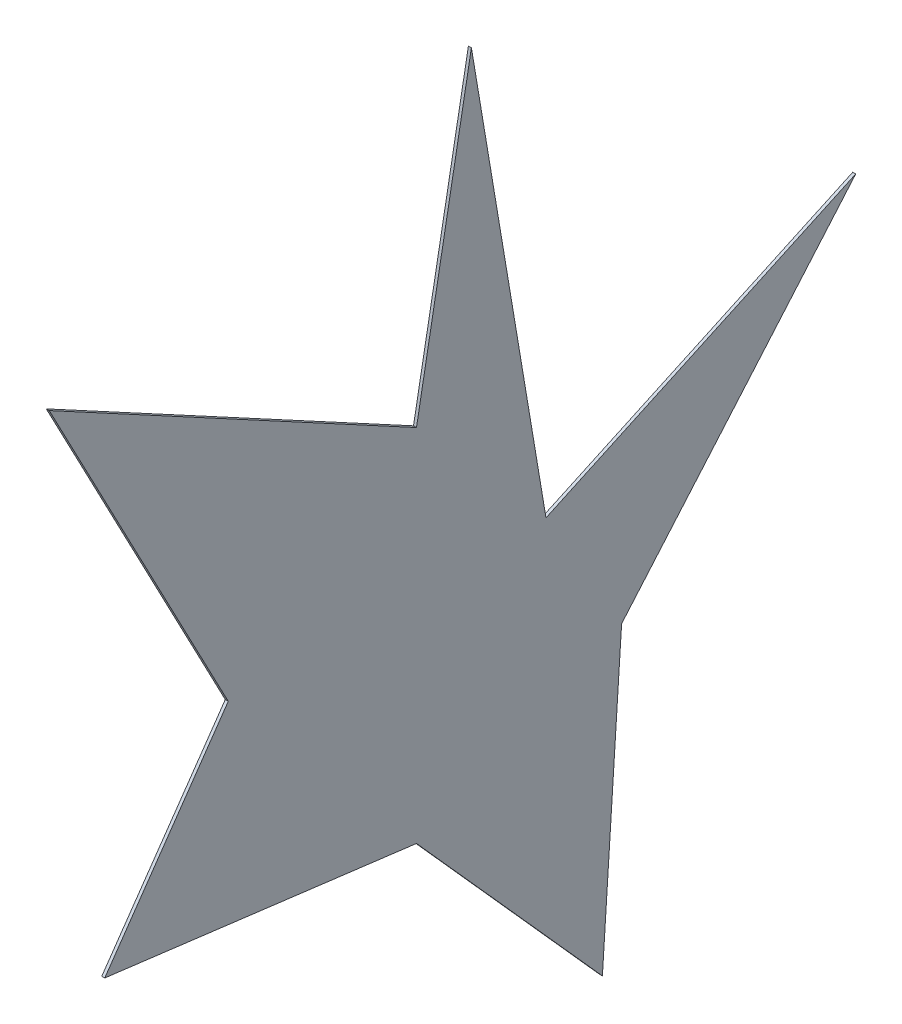
ISO-10303-21;
HEADER;
FILE_DESCRIPTION(('STEP AP214'),'2;1');
FILE_NAME('part.step','',(''),(''),'','','');
FILE_SCHEMA(('AUTOMOTIVE_DESIGN { 1 0 10303 214 1 1 1 1 }'));
ENDSEC;
DATA;
#1=APPLICATION_CONTEXT('core data for automotive mechanical design processes');
#2=APPLICATION_PROTOCOL_DEFINITION('international standard','automotive_design',2000,#1);
#3=PRODUCT_CONTEXT('',#1,'mechanical');
#4=PRODUCT('Part','Part','',(#3));
#5=PRODUCT_RELATED_PRODUCT_CATEGORY('part','',(#4));
#6=PRODUCT_DEFINITION_FORMATION('','',#4);
#7=PRODUCT_DEFINITION_CONTEXT('part definition',#1,'design');
#8=PRODUCT_DEFINITION('design','',#6,#7);
#9=PRODUCT_DEFINITION_SHAPE('','',#8);
#10=(LENGTH_UNIT() NAMED_UNIT(*) SI_UNIT(.MILLI.,.METRE.));
#11=(NAMED_UNIT(*) PLANE_ANGLE_UNIT() SI_UNIT($,.RADIAN.));
#12=(NAMED_UNIT(*) SI_UNIT($,.STERADIAN.) SOLID_ANGLE_UNIT());
#13=UNCERTAINTY_MEASURE_WITH_UNIT(LENGTH_MEASURE(1.E-05),#10,'distance_accuracy_value','');
#14=(GEOMETRIC_REPRESENTATION_CONTEXT(3) GLOBAL_UNCERTAINTY_ASSIGNED_CONTEXT((#13)) GLOBAL_UNIT_ASSIGNED_CONTEXT((#10,
#11,#12)) REPRESENTATION_CONTEXT('',''));
#15=CARTESIAN_POINT('',(0.,0.,0.));
#16=DIRECTION('',(0.,0.,1.));
#17=DIRECTION('',(1.,0.,0.));
#18=AXIS2_PLACEMENT_3D('',#15,#16,#17);
#19=CARTESIAN_POINT('',(10.,-2868.23222967355,4587.69998920282));
#20=DIRECTION('',(0.,-0.464531669646279,0.885556507454855));
#21=DIRECTION('',(0.,-0.885556507454855,-0.464531669646279));
#22=AXIS2_PLACEMENT_3D('',#19,#20,#21);
#23=PLANE('',#22);
#24=DIRECTION('',(0.,0.885556507454854,0.464531669646279));
#25=VECTOR('',#24,1.);
#26=CARTESIAN_POINT('',(0.,-2868.23222967355,4587.69998920282));
#27=LINE('',#26,#25);
#28=CARTESIAN_POINT('',(0.,-2868.23222967355,4587.69998920282));
#29=VERTEX_POINT('',#28);
#30=CARTESIAN_POINT('',(0.,-1720.99502231333,5189.5001125479));
#31=VERTEX_POINT('',#30);
#32=EDGE_CURVE('E146',#29,#31,#27,.T.);
#33=ORIENTED_EDGE('',*,*,#32,.F.);
#34=DIRECTION('',(-1.,0.,0.));
#35=VECTOR('',#34,1.);
#36=CARTESIAN_POINT('',(10.,-2868.23222967355,4587.69998920282));
#37=LINE('',#36,#35);
#38=CARTESIAN_POINT('',(10.,-2868.23222967355,4587.69998920282));
#39=VERTEX_POINT('',#38);
#40=EDGE_CURVE('E11',#39,#29,#37,.T.);
#41=ORIENTED_EDGE('',*,*,#40,.F.);
#42=DIRECTION('',(0.,0.885556507454854,0.464531669646279));
#43=VECTOR('',#42,1.);
#44=CARTESIAN_POINT('',(10.,-2868.23222967355,4587.69998920282));
#45=LINE('',#44,#43);
#46=CARTESIAN_POINT('',(10.,-1720.99502231333,5189.5001125479));
#47=VERTEX_POINT('',#46);
#48=EDGE_CURVE('E172',#39,#47,#45,.T.);
#49=ORIENTED_EDGE('',*,*,#48,.T.);
#50=DIRECTION('',(-1.,0.,0.));
#51=VECTOR('',#50,1.);
#52=CARTESIAN_POINT('',(10.,-1720.99502231333,5189.5001125479));
#53=LINE('',#52,#51);
#54=EDGE_CURVE('E40',#47,#31,#53,.T.);
#55=ORIENTED_EDGE('',*,*,#54,.T.);
#56=EDGE_LOOP('',(#33,#41,#49,#55));
#57=FACE_BOUND('',#56,.T.);
#58=ADVANCED_FACE('F37',(#57),#23,.T.);
#59=CARTESIAN_POINT('',(10.,-3466.21538001409,5002.94207431093));
#60=DIRECTION('',(0.,0.570373576526085,0.821385404789276));
#61=DIRECTION('',(0.,-0.821385404789276,0.570373576526085));
#62=AXIS2_PLACEMENT_3D('',#59,#60,#61);
#63=PLANE('',#62);
#64=DIRECTION('',(0.,0.821385404789276,-0.570373576526085));
#65=VECTOR('',#64,1.);
#66=CARTESIAN_POINT('',(0.,-3466.21538001409,5002.94207431093));
#67=LINE('',#66,#65);
#68=CARTESIAN_POINT('',(0.,-3466.21538001409,5002.94207431093));
#69=VERTEX_POINT('',#68);
#70=EDGE_CURVE('E170',#69,#29,#67,.T.);
#71=ORIENTED_EDGE('',*,*,#70,.F.);
#72=DIRECTION('',(-1.,0.,0.));
#73=VECTOR('',#72,1.);
#74=CARTESIAN_POINT('',(10.,-3466.21538001409,5002.94207431093));
#75=LINE('',#74,#73);
#76=CARTESIAN_POINT('',(10.,-3466.21538001409,5002.94207431093));
#77=VERTEX_POINT('',#76);
#78=EDGE_CURVE('E46',#77,#69,#75,.T.);
#79=ORIENTED_EDGE('',*,*,#78,.F.);
#80=DIRECTION('',(0.,0.821385404789276,-0.570373576526085));
#81=VECTOR('',#80,1.);
#82=CARTESIAN_POINT('',(10.,-3466.21538001409,5002.94207431093));
#83=LINE('',#82,#81);
#84=EDGE_CURVE('E136',#77,#39,#83,.T.);
#85=ORIENTED_EDGE('',*,*,#84,.T.);
#86=ORIENTED_EDGE('',*,*,#40,.T.);
#87=EDGE_LOOP('',(#71,#79,#85,#86));
#88=FACE_BOUND('',#87,.T.);
#89=ADVANCED_FACE('F188',(#88),#63,.T.);
#90=CARTESIAN_POINT('',(10.,-3598.61140715001,3954.91830395219));
#91=DIRECTION('',(0.,-0.992114720662734,0.12533308040699));
#92=DIRECTION('',(0.,-0.12533308040699,-0.992114720662734));
#93=AXIS2_PLACEMENT_3D('',#90,#91,#92);
#94=PLANE('',#93);
#95=DIRECTION('',(0.,0.12533308040699,0.992114720662734));
#96=VECTOR('',#95,1.);
#97=CARTESIAN_POINT('',(0.,-3598.61140715001,3954.91830395219));
#98=LINE('',#97,#96);
#99=CARTESIAN_POINT('',(0.,-3598.61140715001,3954.91830395219));
#100=VERTEX_POINT('',#99);
#101=EDGE_CURVE('E123',#100,#69,#98,.T.);
#102=ORIENTED_EDGE('',*,*,#101,.F.);
#103=DIRECTION('',(-1.,0.,0.));
#104=VECTOR('',#103,1.);
#105=CARTESIAN_POINT('',(10.,-3598.61140715001,3954.91830395219));
#106=LINE('',#105,#104);
#107=CARTESIAN_POINT('',(10.,-3598.61140715001,3954.91830395219));
#108=VERTEX_POINT('',#107);
#109=EDGE_CURVE('E118',#108,#100,#106,.T.);
#110=ORIENTED_EDGE('',*,*,#109,.F.);
#111=DIRECTION('',(0.,0.12533308040699,0.992114720662734));
#112=VECTOR('',#111,1.);
#113=CARTESIAN_POINT('',(10.,-3598.61140715001,3954.91830395219));
#114=LINE('',#113,#112);
#115=EDGE_CURVE('E121',#108,#77,#114,.T.);
#116=ORIENTED_EDGE('',*,*,#115,.T.);
#117=ORIENTED_EDGE('',*,*,#78,.T.);
#118=EDGE_LOOP('',(#102,#110,#116,#117));
#119=FACE_BOUND('',#118,.T.);
#120=ADVANCED_FACE('F120',(#119),#94,.T.);
#121=CARTESIAN_POINT('',(10.,-4296.69955023031,3329.93773141158));
#122=DIRECTION('',(0.,-0.667017339647899,0.745042192502572));
#123=DIRECTION('',(0.,-0.745042192502572,-0.667017339647899));
#124=AXIS2_PLACEMENT_3D('',#121,#122,#123);
#125=PLANE('',#124);
#126=DIRECTION('',(0.,0.745042192502572,0.667017339647899));
#127=VECTOR('',#126,1.);
#128=CARTESIAN_POINT('',(0.,-4296.69955023031,3329.93773141158));
#129=LINE('',#128,#127);
#130=CARTESIAN_POINT('',(0.,-4296.69955023031,3329.93773141158));
#131=VERTEX_POINT('',#130);
#132=EDGE_CURVE('E167',#131,#100,#129,.T.);
#133=ORIENTED_EDGE('',*,*,#132,.F.);
#134=DIRECTION('',(-1.,0.,0.));
#135=VECTOR('',#134,1.);
#136=CARTESIAN_POINT('',(10.,-4296.69955023031,3329.93773141158));
#137=LINE('',#136,#135);
#138=CARTESIAN_POINT('',(10.,-4296.69955023031,3329.93773141158));
#139=VERTEX_POINT('',#138);
#140=EDGE_CURVE('E128',#139,#131,#137,.T.);
#141=ORIENTED_EDGE('',*,*,#140,.F.);
#142=DIRECTION('',(0.,0.745042192502572,0.667017339647899));
#143=VECTOR('',#142,1.);
#144=CARTESIAN_POINT('',(10.,-4296.69955023031,3329.93773141158));
#145=LINE('',#144,#143);
#146=EDGE_CURVE('E134',#139,#108,#145,.T.);
#147=ORIENTED_EDGE('',*,*,#146,.T.);
#148=ORIENTED_EDGE('',*,*,#109,.T.);
#149=EDGE_LOOP('',(#133,#141,#147,#148));
#150=FACE_BOUND('',#149,.T.);
#151=ADVANCED_FACE('F138',(#150),#125,.T.);
#152=CARTESIAN_POINT('',(10.,-3303.56218000998,3265.35566261927));
#153=DIRECTION('',(0.,-0.0648912765560114,-0.997892339998124));
#154=DIRECTION('',(0.,0.997892339998124,-0.0648912765560114));
#155=AXIS2_PLACEMENT_3D('',#152,#153,#154);
#156=PLANE('',#155);
#157=DIRECTION('',(0.,-0.997892339998124,0.0648912765560114));
#158=VECTOR('',#157,1.);
#159=CARTESIAN_POINT('',(0.,-3303.56218000998,3265.35566261927));
#160=LINE('',#159,#158);
#161=CARTESIAN_POINT('',(0.,-3303.56218000998,3265.35566261927));
#162=VERTEX_POINT('',#161);
#163=EDGE_CURVE('E164',#162,#131,#160,.T.);
#164=ORIENTED_EDGE('',*,*,#163,.F.);
#165=DIRECTION('',(-1.,0.,0.));
#166=VECTOR('',#165,1.);
#167=CARTESIAN_POINT('',(10.,-3303.56218000998,3265.35566261927));
#168=LINE('',#167,#166);
#169=CARTESIAN_POINT('',(10.,-3303.56218000998,3265.35566261927));
#170=VERTEX_POINT('',#169);
#171=EDGE_CURVE('E176',#170,#162,#168,.T.);
#172=ORIENTED_EDGE('',*,*,#171,.F.);
#173=DIRECTION('',(0.,-0.997892339998124,0.0648912765560114));
#174=VECTOR('',#173,1.);
#175=CARTESIAN_POINT('',(10.,-3303.56218000998,3265.35566261927));
#176=LINE('',#175,#174);
#177=EDGE_CURVE('E139',#170,#139,#176,.T.);
#178=ORIENTED_EDGE('',*,*,#177,.T.);
#179=ORIENTED_EDGE('',*,*,#140,.T.);
#180=EDGE_LOOP('',(#164,#172,#178,#179));
#181=FACE_BOUND('',#180,.T.);
#182=ADVANCED_FACE('F201',(#181),#156,.T.);
#183=CARTESIAN_POINT('',(10.,-2387.62796450213,2478.279112411));
#184=DIRECTION('',(0.,-0.651740824669321,-0.758441756141732));
#185=DIRECTION('',(0.,0.758441756141732,-0.651740824669321));
#186=AXIS2_PLACEMENT_3D('',#183,#184,#185);
#187=PLANE('',#186);
#188=DIRECTION('',(0.,-0.758441756141732,0.651740824669321));
#189=VECTOR('',#188,1.);
#190=CARTESIAN_POINT('',(0.,-2387.62796450213,2478.279112411));
#191=LINE('',#190,#189);
#192=CARTESIAN_POINT('',(0.,-2387.62796450213,2478.279112411));
#193=VERTEX_POINT('',#192);
#194=EDGE_CURVE('E161',#193,#162,#191,.T.);
#195=ORIENTED_EDGE('',*,*,#194,.F.);
#196=DIRECTION('',(-1.,0.,0.));
#197=VECTOR('',#196,1.);
#198=CARTESIAN_POINT('',(10.,-2387.62796450213,2478.279112411));
#199=LINE('',#198,#197);
#200=CARTESIAN_POINT('',(10.,-2387.62796450213,2478.279112411));
#201=VERTEX_POINT('',#200);
#202=EDGE_CURVE('E178',#201,#193,#199,.T.);
#203=ORIENTED_EDGE('',*,*,#202,.F.);
#204=DIRECTION('',(0.,-0.758441756141732,0.651740824669321));
#205=VECTOR('',#204,1.);
#206=CARTESIAN_POINT('',(10.,-2387.62796450213,2478.279112411));
#207=LINE('',#206,#205);
#208=EDGE_CURVE('E141',#201,#170,#207,.T.);
#209=ORIENTED_EDGE('',*,*,#208,.T.);
#210=ORIENTED_EDGE('',*,*,#171,.T.);
#211=EDGE_LOOP('',(#195,#203,#209,#210));
#212=FACE_BOUND('',#211,.T.);
#213=ADVANCED_FACE('F204',(#212),#187,.T.);
#214=CARTESIAN_POINT('',(10.,-2868.23222967355,3519.58835361575));
#215=DIRECTION('',(0.,0.907959384500452,0.419058177461747));
#216=DIRECTION('',(0.,-0.419058177461747,0.907959384500452));
#217=AXIS2_PLACEMENT_3D('',#214,#215,#216);
#218=PLANE('',#217);
#219=DIRECTION('',(0.,0.419058177461747,-0.907959384500452));
#220=VECTOR('',#219,1.);
#221=CARTESIAN_POINT('',(0.,-2868.23222967355,3519.58835361575));
#222=LINE('',#221,#220);
#223=CARTESIAN_POINT('',(0.,-2868.23222967355,3519.58835361575));
#224=VERTEX_POINT('',#223);
#225=EDGE_CURVE('E158',#224,#193,#222,.T.);
#226=ORIENTED_EDGE('',*,*,#225,.F.);
#227=DIRECTION('',(-1.,0.,0.));
#228=VECTOR('',#227,1.);
#229=CARTESIAN_POINT('',(10.,-2868.23222967355,3519.58835361575));
#230=LINE('',#229,#228);
#231=CARTESIAN_POINT('',(10.,-2868.23222967355,3519.58835361575));
#232=VERTEX_POINT('',#231);
#233=EDGE_CURVE('E180',#232,#224,#230,.T.);
#234=ORIENTED_EDGE('',*,*,#233,.F.);
#235=DIRECTION('',(0.,0.419058177461747,-0.907959384500452));
#236=VECTOR('',#235,1.);
#237=CARTESIAN_POINT('',(10.,-2868.23222967355,3519.58835361575));
#238=LINE('',#237,#236);
#239=EDGE_CURVE('E303',#232,#201,#238,.T.);
#240=ORIENTED_EDGE('',*,*,#239,.T.);
#241=ORIENTED_EDGE('',*,*,#202,.T.);
#242=EDGE_LOOP('',(#226,#234,#240,#241));
#243=FACE_BOUND('',#242,.T.);
#244=ADVANCED_FACE('F208',(#243),#218,.T.);
#245=CARTESIAN_POINT('',(10.,-1374.17984011891,3770.33840500954));
#246=DIRECTION('',(0.,0.16551724137931,-0.986206896551724));
#247=DIRECTION('',(0.,0.986206896551724,0.16551724137931));
#248=AXIS2_PLACEMENT_3D('',#245,#246,#247);
#249=PLANE('',#248);
#250=DIRECTION('',(0.,-0.986206896551724,-0.16551724137931));
#251=VECTOR('',#250,1.);
#252=CARTESIAN_POINT('',(0.,-1374.17984011891,3770.33840500954));
#253=LINE('',#252,#251);
#254=CARTESIAN_POINT('',(0.,-1374.17984011891,3770.33840500954));
#255=VERTEX_POINT('',#254);
#256=EDGE_CURVE('E155',#255,#224,#253,.T.);
#257=ORIENTED_EDGE('',*,*,#256,.F.);
#258=DIRECTION('',(-1.,0.,0.));
#259=VECTOR('',#258,1.);
#260=CARTESIAN_POINT('',(10.,-1374.17984011891,3770.33840500954));
#261=LINE('',#260,#259);
#262=CARTESIAN_POINT('',(10.,-1374.17984011891,3770.33840500954));
#263=VERTEX_POINT('',#262);
#264=EDGE_CURVE('E182',#263,#255,#261,.T.);
#265=ORIENTED_EDGE('',*,*,#264,.F.);
#266=DIRECTION('',(0.,-0.986206896551724,-0.16551724137931));
#267=VECTOR('',#266,1.);
#268=CARTESIAN_POINT('',(10.,-1374.17984011891,3770.33840500954));
#269=LINE('',#268,#267);
#270=EDGE_CURVE('E299',#263,#232,#269,.T.);
#271=ORIENTED_EDGE('',*,*,#270,.T.);
#272=ORIENTED_EDGE('',*,*,#233,.T.);
#273=EDGE_LOOP('',(#257,#265,#271,#272));
#274=FACE_BOUND('',#273,.T.);
#275=ADVANCED_FACE('F212',(#274),#249,.T.);
#276=CARTESIAN_POINT('',(10.,-2387.62796450213,3954.91830395219));
#277=DIRECTION('',(0.,0.179182941320224,0.983815772154438));
#278=DIRECTION('',(0.,-0.983815772154438,0.179182941320224));
#279=AXIS2_PLACEMENT_3D('',#276,#277,#278);
#280=PLANE('',#279);
#281=DIRECTION('',(0.,0.983815772154438,-0.179182941320224));
#282=VECTOR('',#281,1.);
#283=CARTESIAN_POINT('',(0.,-2387.62796450213,3954.91830395219));
#284=LINE('',#283,#282);
#285=CARTESIAN_POINT('',(0.,-2387.62796450213,3954.91830395219));
#286=VERTEX_POINT('',#285);
#287=EDGE_CURVE('E152',#286,#255,#284,.T.);
#288=ORIENTED_EDGE('',*,*,#287,.F.);
#289=DIRECTION('',(-1.,0.,0.));
#290=VECTOR('',#289,1.);
#291=CARTESIAN_POINT('',(10.,-2387.62796450213,3954.91830395219));
#292=LINE('',#291,#290);
#293=CARTESIAN_POINT('',(10.,-2387.62796450213,3954.91830395219));
#294=VERTEX_POINT('',#293);
#295=EDGE_CURVE('E183',#294,#286,#292,.T.);
#296=ORIENTED_EDGE('',*,*,#295,.F.);
#297=DIRECTION('',(0.,0.983815772154438,-0.179182941320224));
#298=VECTOR('',#297,1.);
#299=CARTESIAN_POINT('',(10.,-2387.62796450213,3954.91830395219));
#300=LINE('',#299,#298);
#301=EDGE_CURVE('E310',#294,#263,#300,.T.);
#302=ORIENTED_EDGE('',*,*,#301,.T.);
#303=ORIENTED_EDGE('',*,*,#264,.T.);
#304=EDGE_LOOP('',(#288,#296,#302,#303));
#305=FACE_BOUND('',#304,.T.);
#306=ADVANCED_FACE('F216',(#305),#280,.T.);
#307=CARTESIAN_POINT('',(10.,-1720.99502231333,5189.5001125479));
#308=DIRECTION('',(0.,0.879917684427345,-0.47512616075314));
#309=DIRECTION('',(0.,0.47512616075314,0.879917684427345));
#310=AXIS2_PLACEMENT_3D('',#307,#308,#309);
#311=PLANE('',#310);
#312=DIRECTION('',(0.,-0.47512616075314,-0.879917684427345));
#313=VECTOR('',#312,1.);
#314=CARTESIAN_POINT('',(0.,-1720.99502231333,5189.5001125479));
#315=LINE('',#314,#313);
#316=EDGE_CURVE('E149',#31,#286,#315,.T.);
#317=ORIENTED_EDGE('',*,*,#316,.F.);
#318=ORIENTED_EDGE('',*,*,#54,.F.);
#319=DIRECTION('',(0.,-0.47512616075314,-0.879917684427345));
#320=VECTOR('',#319,1.);
#321=CARTESIAN_POINT('',(10.,-1720.99502231333,5189.5001125479));
#322=LINE('',#321,#320);
#323=EDGE_CURVE('E312',#47,#294,#322,.T.);
#324=ORIENTED_EDGE('',*,*,#323,.T.);
#325=ORIENTED_EDGE('',*,*,#295,.T.);
#326=EDGE_LOOP('',(#317,#318,#324,#325));
#327=FACE_BOUND('',#326,.T.);
#328=ADVANCED_FACE('F185',(#327),#311,.T.);
#329=CARTESIAN_POINT('',(10.,0.,0.));
#330=DIRECTION('',(-1.,0.,0.));
#331=DIRECTION('',(0.,0.,1.));
#332=AXIS2_PLACEMENT_3D('',#329,#330,#331);
#333=PLANE('',#332);
#334=ORIENTED_EDGE('',*,*,#48,.F.);
#335=ORIENTED_EDGE('',*,*,#84,.F.);
#336=ORIENTED_EDGE('',*,*,#115,.F.);
#337=ORIENTED_EDGE('',*,*,#146,.F.);
#338=ORIENTED_EDGE('',*,*,#177,.F.);
#339=ORIENTED_EDGE('',*,*,#208,.F.);
#340=ORIENTED_EDGE('',*,*,#239,.F.);
#341=ORIENTED_EDGE('',*,*,#270,.F.);
#342=ORIENTED_EDGE('',*,*,#301,.F.);
#343=ORIENTED_EDGE('',*,*,#323,.F.);
#344=EDGE_LOOP('',(#334,#335,#336,#337,#338,#339,#340,#341,#342,#343));
#345=FACE_BOUND('',#344,.T.);
#346=ADVANCED_FACE('F132',(#345),#333,.F.);
#347=CARTESIAN_POINT('',(0.,0.,0.));
#348=DIRECTION('',(-1.,0.,0.));
#349=DIRECTION('',(0.,0.,1.));
#350=AXIS2_PLACEMENT_3D('',#347,#348,#349);
#351=PLANE('',#350);
#352=ORIENTED_EDGE('',*,*,#32,.T.);
#353=ORIENTED_EDGE('',*,*,#316,.T.);
#354=ORIENTED_EDGE('',*,*,#287,.T.);
#355=ORIENTED_EDGE('',*,*,#256,.T.);
#356=ORIENTED_EDGE('',*,*,#225,.T.);
#357=ORIENTED_EDGE('',*,*,#194,.T.);
#358=ORIENTED_EDGE('',*,*,#163,.T.);
#359=ORIENTED_EDGE('',*,*,#132,.T.);
#360=ORIENTED_EDGE('',*,*,#101,.T.);
#361=ORIENTED_EDGE('',*,*,#70,.T.);
#362=EDGE_LOOP('',(#352,#353,#354,#355,#356,#357,#358,#359,#360,#361));
#363=FACE_BOUND('',#362,.T.);
#364=ADVANCED_FACE('F187',(#363),#351,.T.);
#365=CLOSED_SHELL('',(#58,#89,#120,#151,#182,#213,#244,#275,#306,#328,#346,#364));
#366=MANIFOLD_SOLID_BREP('B2',#365);
#367=ADVANCED_BREP_SHAPE_REPRESENTATION('',(#18,#366),#14);
#368=SHAPE_DEFINITION_REPRESENTATION(#9,#367);
ENDSEC;
END-ISO-10303-21;
